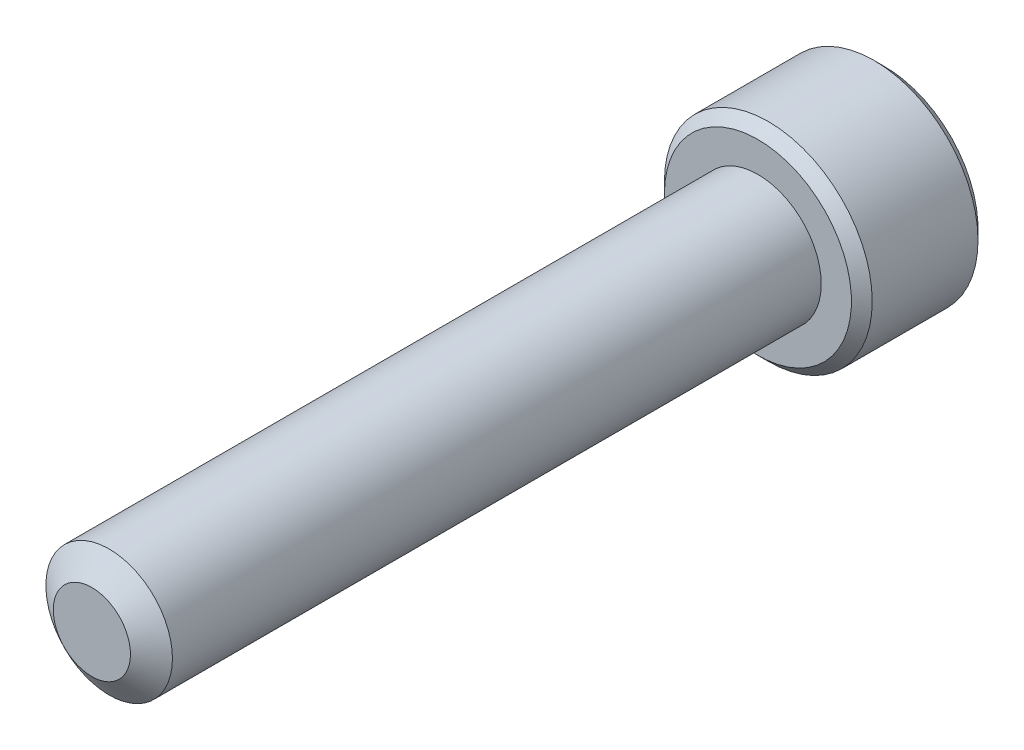
ISO-10303-21;
HEADER;
FILE_DESCRIPTION(('STEP AP214'),'2;1');
FILE_NAME('part.step','',(''),(''),'','','');
FILE_SCHEMA(('AUTOMOTIVE_DESIGN { 1 0 10303 214 1 1 1 1 }'));
ENDSEC;
DATA;
#1=APPLICATION_CONTEXT('core data for automotive mechanical design processes');
#2=APPLICATION_PROTOCOL_DEFINITION('international standard','automotive_design',2000,#1);
#3=PRODUCT_CONTEXT('',#1,'mechanical');
#4=PRODUCT('Part','Part','',(#3));
#5=PRODUCT_RELATED_PRODUCT_CATEGORY('part','',(#4));
#6=PRODUCT_DEFINITION_FORMATION('','',#4);
#7=PRODUCT_DEFINITION_CONTEXT('part definition',#1,'design');
#8=PRODUCT_DEFINITION('design','',#6,#7);
#9=PRODUCT_DEFINITION_SHAPE('','',#8);
#10=(LENGTH_UNIT() NAMED_UNIT(*) SI_UNIT(.MILLI.,.METRE.));
#11=(NAMED_UNIT(*) PLANE_ANGLE_UNIT() SI_UNIT($,.RADIAN.));
#12=(NAMED_UNIT(*) SI_UNIT($,.STERADIAN.) SOLID_ANGLE_UNIT());
#13=UNCERTAINTY_MEASURE_WITH_UNIT(LENGTH_MEASURE(1.E-05),#10,'distance_accuracy_value','');
#14=(GEOMETRIC_REPRESENTATION_CONTEXT(3) GLOBAL_UNCERTAINTY_ASSIGNED_CONTEXT((#13)) GLOBAL_UNIT_ASSIGNED_CONTEXT((#10,
#11,#12)) REPRESENTATION_CONTEXT('',''));
#15=CARTESIAN_POINT('',(0.,0.,0.));
#16=DIRECTION('',(0.,0.,1.));
#17=DIRECTION('',(1.,0.,0.));
#18=AXIS2_PLACEMENT_3D('',#15,#16,#17);
#19=CARTESIAN_POINT('',(0.,0.,-25.4));
#20=DIRECTION('',(0.,0.,1.));
#21=DIRECTION('',(1.,0.,0.));
#22=AXIS2_PLACEMENT_3D('',#19,#20,#21);
#23=CYLINDRICAL_SURFACE('',#22,2.413);
#24=CARTESIAN_POINT('',(0.,0.,-0.659180743038974));
#25=DIRECTION('',(0.,0.,1.));
#26=DIRECTION('',(1.,0.,0.));
#27=AXIS2_PLACEMENT_3D('',#24,#25,#26);
#28=CIRCLE('',#27,2.413);
#29=CARTESIAN_POINT('',(2.413,0.,-0.659180743038974));
#30=VERTEX_POINT('',#29);
#31=EDGE_CURVE('E112',#30,#30,#28,.T.);
#32=ORIENTED_EDGE('',*,*,#31,.F.);
#33=EDGE_LOOP('',(#32));
#34=FACE_BOUND('',#33,.T.);
#35=CARTESIAN_POINT('',(0.,0.,-25.4));
#36=DIRECTION('',(0.,0.,-1.));
#37=DIRECTION('',(-1.,0.,0.));
#38=AXIS2_PLACEMENT_3D('',#35,#36,#37);
#39=CIRCLE('',#38,2.413);
#40=CARTESIAN_POINT('',(-2.413,0.,-25.4));
#41=VERTEX_POINT('',#40);
#42=EDGE_CURVE('E218',#41,#41,#39,.F.);
#43=ORIENTED_EDGE('',*,*,#42,.T.);
#44=EDGE_LOOP('',(#43));
#45=FACE_BOUND('',#44,.T.);
#46=ADVANCED_FACE('F38',(#34,#45),#23,.T.);
#47=CARTESIAN_POINT('',(0.,0.,0.));
#48=DIRECTION('',(0.,0.,-1.));
#49=DIRECTION('',(-1.,0.,0.));
#50=AXIS2_PLACEMENT_3D('',#47,#48,#49);
#51=CONICAL_SURFACE('',#50,1.4715923357461,0.959931088596884);
#52=ORIENTED_EDGE('',*,*,#31,.T.);
#53=EDGE_LOOP('',(#52));
#54=FACE_BOUND('',#53,.T.);
#55=CARTESIAN_POINT('',(0.,0.,0.));
#56=DIRECTION('',(0.,0.,1.));
#57=DIRECTION('',(1.,0.,0.));
#58=AXIS2_PLACEMENT_3D('',#55,#56,#57);
#59=CIRCLE('',#58,1.4715923357461);
#60=CARTESIAN_POINT('',(1.4715923357461,0.,0.));
#61=VERTEX_POINT('',#60);
#62=EDGE_CURVE('E216',#61,#61,#59,.T.);
#63=ORIENTED_EDGE('',*,*,#62,.F.);
#64=EDGE_LOOP('',(#63));
#65=FACE_BOUND('',#64,.T.);
#66=ADVANCED_FACE('F199',(#54,#65),#51,.T.);
#67=CARTESIAN_POINT('',(0.,0.,0.));
#68=DIRECTION('',(0.,0.,1.));
#69=DIRECTION('',(1.,0.,0.));
#70=AXIS2_PLACEMENT_3D('',#67,#68,#69);
#71=PLANE('',#70);
#72=ORIENTED_EDGE('',*,*,#62,.T.);
#73=EDGE_LOOP('',(#72));
#74=FACE_BOUND('',#73,.T.);
#75=ADVANCED_FACE('F196',(#74),#71,.T.);
#76=CARTESIAN_POINT('',(0.,0.,-30.226));
#77=DIRECTION('',(0.,0.,1.));
#78=DIRECTION('',(1.,0.,0.));
#79=AXIS2_PLACEMENT_3D('',#76,#77,#78);
#80=CYLINDRICAL_SURFACE('',#79,3.9624);
#81=CARTESIAN_POINT('',(0.,0.,-29.82976));
#82=DIRECTION('',(0.,0.,-1.));
#83=DIRECTION('',(-1.,0.,0.));
#84=AXIS2_PLACEMENT_3D('',#81,#82,#83);
#85=CIRCLE('',#84,3.9624);
#86=CARTESIAN_POINT('',(-3.9624,0.,-29.82976));
#87=VERTEX_POINT('',#86);
#88=EDGE_CURVE('E46',#87,#87,#85,.F.);
#89=ORIENTED_EDGE('',*,*,#88,.T.);
#90=EDGE_LOOP('',(#89));
#91=FACE_BOUND('',#90,.T.);
#92=CARTESIAN_POINT('',(0.,0.,-25.79624));
#93=DIRECTION('',(0.,0.,-1.));
#94=DIRECTION('',(-1.,0.,0.));
#95=AXIS2_PLACEMENT_3D('',#92,#93,#94);
#96=CIRCLE('',#95,3.9624);
#97=CARTESIAN_POINT('',(-3.9624,0.,-25.79624));
#98=VERTEX_POINT('',#97);
#99=EDGE_CURVE('E175',#98,#98,#96,.T.);
#100=ORIENTED_EDGE('',*,*,#99,.T.);
#101=EDGE_LOOP('',(#100));
#102=FACE_BOUND('',#101,.T.);
#103=ADVANCED_FACE('F180',(#91,#102),#80,.T.);
#104=CARTESIAN_POINT('',(0.,0.,-30.226));
#105=DIRECTION('',(0.,0.,-1.));
#106=DIRECTION('',(-1.,0.,0.));
#107=AXIS2_PLACEMENT_3D('',#104,#105,#106);
#108=PLANE('',#107);
#109=CARTESIAN_POINT('',(0.,0.,-30.226));
#110=DIRECTION('',(0.,0.,-1.));
#111=DIRECTION('',(-1.,0.,0.));
#112=AXIS2_PLACEMENT_3D('',#109,#110,#111);
#113=CIRCLE('',#112,3.56616);
#114=CARTESIAN_POINT('',(-3.56616,0.,-30.226));
#115=VERTEX_POINT('',#114);
#116=EDGE_CURVE('E111',#115,#115,#113,.T.);
#117=ORIENTED_EDGE('',*,*,#116,.T.);
#118=EDGE_LOOP('',(#117));
#119=FACE_BOUND('',#118,.T.);
#120=CARTESIAN_POINT('',(0.,0.,-30.226));
#121=DIRECTION('',(0.,0.,-1.));
#122=DIRECTION('',(-1.,0.,0.));
#123=AXIS2_PLACEMENT_3D('',#120,#121,#122);
#124=CIRCLE('',#123,2.29135888084633);
#125=CARTESIAN_POINT('',(-1.984375,1.14567944042316,-30.226));
#126=VERTEX_POINT('',#125);
#127=CARTESIAN_POINT('',(0.,2.29135888084633,-30.226));
#128=VERTEX_POINT('',#127);
#129=EDGE_CURVE('E92',#126,#128,#124,.T.);
#130=ORIENTED_EDGE('',*,*,#129,.F.);
#131=CARTESIAN_POINT('',(-1.984375,-1.14567944042316,-30.226));
#132=VERTEX_POINT('',#131);
#133=EDGE_CURVE('E52',#132,#126,#124,.T.);
#134=ORIENTED_EDGE('',*,*,#133,.F.);
#135=CARTESIAN_POINT('',(0.,-2.29135888084633,-30.226));
#136=VERTEX_POINT('',#135);
#137=EDGE_CURVE('E278',#136,#132,#124,.T.);
#138=ORIENTED_EDGE('',*,*,#137,.F.);
#139=CARTESIAN_POINT('',(1.984375,-1.14567944042316,-30.226));
#140=VERTEX_POINT('',#139);
#141=EDGE_CURVE('E59',#140,#136,#124,.T.);
#142=ORIENTED_EDGE('',*,*,#141,.F.);
#143=CARTESIAN_POINT('',(1.984375,1.14567944042316,-30.226));
#144=VERTEX_POINT('',#143);
#145=EDGE_CURVE('E133',#144,#140,#124,.T.);
#146=ORIENTED_EDGE('',*,*,#145,.F.);
#147=EDGE_CURVE('E101',#128,#144,#124,.T.);
#148=ORIENTED_EDGE('',*,*,#147,.F.);
#149=EDGE_LOOP('',(#130,#134,#138,#142,#146,#148));
#150=FACE_BOUND('',#149,.T.);
#151=ADVANCED_FACE('F132',(#119,#150),#108,.T.);
#152=CARTESIAN_POINT('',(0.,0.,-25.4));
#153=DIRECTION('',(0.,0.,-1.));
#154=DIRECTION('',(-1.,0.,0.));
#155=AXIS2_PLACEMENT_3D('',#152,#153,#154);
#156=PLANE('',#155);
#157=CARTESIAN_POINT('',(0.,0.,-25.4));
#158=DIRECTION('',(0.,0.,-1.));
#159=DIRECTION('',(-1.,0.,0.));
#160=AXIS2_PLACEMENT_3D('',#157,#158,#159);
#161=CIRCLE('',#160,3.56616);
#162=CARTESIAN_POINT('',(-3.56616,0.,-25.4));
#163=VERTEX_POINT('',#162);
#164=EDGE_CURVE('E11',#163,#163,#161,.F.);
#165=ORIENTED_EDGE('',*,*,#164,.T.);
#166=EDGE_LOOP('',(#165));
#167=FACE_BOUND('',#166,.T.);
#168=ORIENTED_EDGE('',*,*,#42,.F.);
#169=EDGE_LOOP('',(#168));
#170=FACE_BOUND('',#169,.T.);
#171=ADVANCED_FACE('F189',(#167,#170),#156,.F.);
#172=CARTESIAN_POINT('',(0.,0.,-30.226));
#173=DIRECTION('',(0.,0.,-1.));
#174=DIRECTION('',(-1.,0.,0.));
#175=AXIS2_PLACEMENT_3D('',#172,#173,#174);
#176=CONICAL_SURFACE('',#175,2.29135888084633,0.78539816339745);
#177=ORIENTED_EDGE('',*,*,#147,.T.);
#178=CARTESIAN_POINT('',(-0.000199999999999787,2.29147435090016,-30.2261154787818));
#179=CARTESIAN_POINT('',(0.0680159951668027,2.25208982772757,-30.1867628522639));
#180=CARTESIAN_POINT('',(0.137372685106966,2.21204672412052,-30.1497213104462));
#181=CARTESIAN_POINT('',(0.278798800452188,2.13039431835551,-30.0818988584233));
#182=CARTESIAN_POINT('',(0.350881678736783,2.08877724917394,-30.0511556890918));
#183=CARTESIAN_POINT('',(0.496233397266004,2.00485839535392,-29.9984918888112));
#184=CARTESIAN_POINT('',(0.569465212486938,1.96257798712287,-29.97643887588));
#185=CARTESIAN_POINT('',(0.717541182594705,1.87708628592063,-29.9424614929439));
#186=CARTESIAN_POINT('',(0.792380812753423,1.83387760530244,-29.9305117560917));
#187=CARTESIAN_POINT('',(0.921360414543814,1.75941119748879,-29.9197300990819));
#188=CARTESIAN_POINT('',(0.975333715772441,1.72824969749539,-29.9181338990591));
#189=CARTESIAN_POINT('',(1.0831921185198,1.66597761963484,-29.9208218388653));
#190=CARTESIAN_POINT('',(1.13707718248552,1.63486706344893,-29.9251080403405));
#191=CARTESIAN_POINT('',(1.2443385382486,1.57293969082547,-29.9393168730135));
#192=CARTESIAN_POINT('',(1.29771419276014,1.54212324232506,-29.9492458104523));
#193=CARTESIAN_POINT('',(1.40354251740889,1.48102323060122,-29.9741950842745));
#194=CARTESIAN_POINT('',(1.4559952579711,1.45073962671789,-29.9892150303895));
#195=CARTESIAN_POINT('',(1.59035733896365,1.37316564308797,-30.0338078516357));
#196=CARTESIAN_POINT('',(1.67143335715832,1.32635638215845,-30.0667429959383));
#197=CARTESIAN_POINT('',(1.79064830672984,1.25752759893191,-30.1223424412022));
#198=CARTESIAN_POINT('',(1.829934924386,1.23484545965257,-30.1418775920519));
#199=CARTESIAN_POINT('',(1.90778036186805,1.18990137536713,-30.1827287381194));
#200=CARTESIAN_POINT('',(1.9463396111017,1.16763918244233,-30.2040436395684));
#201=CARTESIAN_POINT('',(1.984575,1.14556397036933,-30.2261154787818));
#202=B_SPLINE_CURVE_WITH_KNOTS('',3,(#178,#179,#180,#181,#182,#183,#184,#185,#186,#187,#188,
#189,#190,#191,#192,#193,#194,#195,#196,#197,#198,#199,#200,#201),.UNSPECIFIED.,.F.,.F.,(4,2,2,
2,2,2,2,2,2,2,2,4),(0.,0.264339630306627,0.530219665093694,0.791876416371459,1.05287424418109,
1.239639843932,1.42647091743852,1.61351120244034,1.8005371524754,2.09764209964316,
2.24579179873714,2.39385111134157),.UNSPECIFIED.);
#203=EDGE_CURVE('E106',#128,#144,#202,.T.);
#204=ORIENTED_EDGE('',*,*,#203,.F.);
#205=EDGE_LOOP('',(#177,#204));
#206=FACE_BOUND('',#205,.T.);
#207=ADVANCED_FACE('F107',(#206),#176,.F.);
#208=ORIENTED_EDGE('',*,*,#145,.T.);
#209=CARTESIAN_POINT('',(1.984375,-2.28495242157822,-30.9609840788166));
#210=CARTESIAN_POINT('',(1.984375,-2.22931635455402,-30.9189866855508));
#211=CARTESIAN_POINT('',(1.984375,-2.17336876548389,-30.8773960540763));
#212=CARTESIAN_POINT('',(1.984375,-2.06072770258171,-30.7952084614715));
#213=CARTESIAN_POINT('',(1.984375,-2.00403404503435,-30.754611752405));
#214=CARTESIAN_POINT('',(1.984375,-1.88936329173488,-30.6743035031747));
#215=CARTESIAN_POINT('',(1.984375,-1.83137965519348,-30.6346012588133));
#216=CARTESIAN_POINT('',(1.984375,-1.7144280213784,-30.5566851734013));
#217=CARTESIAN_POINT('',(1.984375,-1.65546009407227,-30.5184712271944));
#218=CARTESIAN_POINT('',(1.984375,-1.47005472306035,-30.4022528340136));
#219=CARTESIAN_POINT('',(1.984375,-1.34163909427883,-30.3273478868724));
#220=CARTESIAN_POINT('',(1.984375,-1.0784038470548,-30.1903302154397));
#221=CARTESIAN_POINT('',(1.984375,-0.943607781407423,-30.1281743664824));
#222=CARTESIAN_POINT('',(1.984375,-0.74127510044488,-30.0521325786886));
#223=CARTESIAN_POINT('',(1.984375,-0.676735408881093,-30.030308061326));
#224=CARTESIAN_POINT('',(1.984375,-0.54609811811276,-29.9918404635378));
#225=CARTESIAN_POINT('',(1.984375,-0.480000411919955,-29.9751977400655));
#226=CARTESIAN_POINT('',(1.984375,-0.347746170028531,-29.9482353808697));
#227=CARTESIAN_POINT('',(1.984375,-0.281612071479122,-29.9378074097359));
#228=CARTESIAN_POINT('',(1.984375,-0.14863662005235,-29.9234781473766));
#229=CARTESIAN_POINT('',(1.984375,-0.0817953907393247,-29.9195757342274));
#230=CARTESIAN_POINT('',(1.984375,0.0495156750890629,-29.9185870513327));
#231=CARTESIAN_POINT('',(1.984375,0.11398377510299,-29.921259178875));
#232=CARTESIAN_POINT('',(1.984375,0.242367515846176,-29.9327392104975));
#233=CARTESIAN_POINT('',(1.984375,0.306283102295918,-29.9415477106392));
#234=CARTESIAN_POINT('',(1.984375,0.434181040262183,-29.9649690213329));
#235=CARTESIAN_POINT('',(1.984375,0.498145026858308,-29.9796806062321));
#236=CARTESIAN_POINT('',(1.984375,0.624675616953006,-30.0141261814121));
#237=CARTESIAN_POINT('',(1.984375,0.687242336899688,-30.0338597514492));
#238=CARTESIAN_POINT('',(1.984375,0.884225483826086,-30.1034122372308));
#239=CARTESIAN_POINT('',(1.984375,1.01583674256468,-30.1611524112565));
#240=CARTESIAN_POINT('',(1.984375,1.27288659242652,-30.2895303365888));
#241=CARTESIAN_POINT('',(1.984375,1.3983008827048,-30.3602144249194));
#242=CARTESIAN_POINT('',(1.984375,1.57956687990221,-30.4705166638132));
#243=CARTESIAN_POINT('',(1.984375,1.63738271299424,-30.5069698294754));
#244=CARTESIAN_POINT('',(1.984375,1.75202215386201,-30.5814159632917));
#245=CARTESIAN_POINT('',(1.984375,1.80884568601361,-30.6194090480781));
#246=CARTESIAN_POINT('',(1.984375,1.92116923084255,-30.6963388088931));
#247=CARTESIAN_POINT('',(1.984375,1.97667624512253,-30.7352653130388));
#248=CARTESIAN_POINT('',(1.984375,2.08693170717166,-30.8141477461214));
#249=CARTESIAN_POINT('',(1.984375,2.14168035934792,-30.854103389024));
#250=CARTESIAN_POINT('',(1.984375,2.19611149046622,-30.8944806112854));
#251=B_SPLINE_CURVE_WITH_KNOTS('',3,(#209,#210,#211,#212,#213,#214,#215,#216,#217,#218,#219,
#220,#221,#222,#223,#224,#225,#226,#227,#228,#229,#230,#231,#232,#233,#234,#235,#236,#237,#238,
#239,#240,#241,#242,#243,#244,#245,#246,#247,#248,#249,#250),.UNSPECIFIED.,.F.,.F.,(4,2,2,2,2,2,
2,2,2,2,2,2,2,2,2,2,2,2,2,2,4),(0.,0.209126070008321,0.418304637356568,0.629103979977996,
0.839888401371182,1.28549951116127,1.72957750768351,1.93379389749971,2.13802435186698,
2.33858179514333,2.53910475350639,2.73236963400794,2.92565329006886,3.12231577097487,
3.31896180041345,3.74886295245172,4.18033428125362,4.38536017180289,4.59040161996382,
4.79377749165107,4.99709743524131),.UNSPECIFIED.);
#252=EDGE_CURVE('E100',#144,#140,#251,.F.);
#253=ORIENTED_EDGE('',*,*,#252,.F.);
#254=EDGE_LOOP('',(#208,#253));
#255=FACE_BOUND('',#254,.T.);
#256=ADVANCED_FACE('F284',(#255),#176,.F.);
#257=ORIENTED_EDGE('',*,*,#141,.T.);
#258=CARTESIAN_POINT('',(1.984575,-1.14556397036933,-30.2261154787818));
#259=CARTESIAN_POINT('',(1.9163590048332,-1.18494849354192,-30.1867628522639));
#260=CARTESIAN_POINT('',(1.84700231489303,-1.22499159714897,-30.1497213104462));
#261=CARTESIAN_POINT('',(1.70557619954781,-1.30664400291398,-30.0818988584233));
#262=CARTESIAN_POINT('',(1.63349332126322,-1.34826107209555,-30.0511556890918));
#263=CARTESIAN_POINT('',(1.488141602734,-1.43217992591557,-29.9984918888112));
#264=CARTESIAN_POINT('',(1.41490978751306,-1.47446033414663,-29.97643887588));
#265=CARTESIAN_POINT('',(1.26683381740529,-1.55995203534886,-29.9424614929439));
#266=CARTESIAN_POINT('',(1.19199418724658,-1.60316071596705,-29.9305117560917));
#267=CARTESIAN_POINT('',(1.06301458545619,-1.6776271237807,-29.9197300990819));
#268=CARTESIAN_POINT('',(1.00904128422756,-1.7087886237741,-29.9181338990591));
#269=CARTESIAN_POINT('',(0.901182881480201,-1.77106070163465,-29.9208218388653));
#270=CARTESIAN_POINT('',(0.847297817514478,-1.80217125782056,-29.9251080403405));
#271=CARTESIAN_POINT('',(0.740036461751398,-1.86409863044402,-29.9393168730135));
#272=CARTESIAN_POINT('',(0.686660807239862,-1.89491507894443,-29.9492458104523));
#273=CARTESIAN_POINT('',(0.580832482591106,-1.95601509066827,-29.9741950842745));
#274=CARTESIAN_POINT('',(0.5283797420289,-1.9862986945516,-29.9892150303895));
#275=CARTESIAN_POINT('',(0.394017661036352,-2.06387267818152,-30.0338078516357));
#276=CARTESIAN_POINT('',(0.312941642841676,-2.11068193911104,-30.0667429959383));
#277=CARTESIAN_POINT('',(0.193726693270161,-2.17951072233758,-30.1223424412022));
#278=CARTESIAN_POINT('',(0.154440075613999,-2.20219286161692,-30.1418775920519));
#279=CARTESIAN_POINT('',(0.0765946381319474,-2.24713694590237,-30.1827287381194));
#280=CARTESIAN_POINT('',(0.0380353888983019,-2.26939913882716,-30.2040436395684));
#281=CARTESIAN_POINT('',(-0.000199999999999489,-2.29147435090017,-30.2261154787818));
#282=B_SPLINE_CURVE_WITH_KNOTS('',3,(#258,#259,#260,#261,#262,#263,#264,#265,#266,#267,#268,
#269,#270,#271,#272,#273,#274,#275,#276,#277,#278,#279,#280,#281),.UNSPECIFIED.,.F.,.F.,(4,2,2,
2,2,2,2,2,2,2,2,4),(0.,0.264339630306627,0.530219665093694,0.791876416371459,1.05287424418109,
1.239639843932,1.42647091743852,1.61351120244034,1.8005371524754,2.09764209964316,
2.24579179873714,2.39385111134157),.UNSPECIFIED.);
#283=EDGE_CURVE('E143',#140,#136,#282,.T.);
#284=ORIENTED_EDGE('',*,*,#283,.F.);
#285=EDGE_LOOP('',(#257,#284));
#286=FACE_BOUND('',#285,.T.);
#287=ADVANCED_FACE('F281',(#286),#176,.F.);
#288=ORIENTED_EDGE('',*,*,#137,.T.);
#289=CARTESIAN_POINT('',(0.000200000000000205,-2.29147435090017,-30.2261154787818));
#290=CARTESIAN_POINT('',(-0.0680159951668026,-2.25208982772757,-30.1867628522639));
#291=CARTESIAN_POINT('',(-0.137372685106966,-2.21204672412052,-30.1497213104462));
#292=CARTESIAN_POINT('',(-0.278798800452187,-2.13039431835551,-30.0818988584233));
#293=CARTESIAN_POINT('',(-0.350881678736782,-2.08877724917394,-30.0511556890918));
#294=CARTESIAN_POINT('',(-0.496233397266003,-2.00485839535392,-29.9984918888112));
#295=CARTESIAN_POINT('',(-0.569465212486937,-1.96257798712287,-29.97643887588));
#296=CARTESIAN_POINT('',(-0.717541182594704,-1.87708628592063,-29.9424614929439));
#297=CARTESIAN_POINT('',(-0.792380812753422,-1.83387760530244,-29.9305117560917));
#298=CARTESIAN_POINT('',(-0.921360414543813,-1.75941119748879,-29.9197300990819));
#299=CARTESIAN_POINT('',(-0.97533371577244,-1.72824969749539,-29.9181338990591));
#300=CARTESIAN_POINT('',(-1.0831921185198,-1.66597761963484,-29.9208218388653));
#301=CARTESIAN_POINT('',(-1.13707718248552,-1.63486706344893,-29.9251080403405));
#302=CARTESIAN_POINT('',(-1.2443385382486,-1.57293969082547,-29.9393168730135));
#303=CARTESIAN_POINT('',(-1.29771419276014,-1.54212324232506,-29.9492458104523));
#304=CARTESIAN_POINT('',(-1.40354251740889,-1.48102323060122,-29.9741950842745));
#305=CARTESIAN_POINT('',(-1.4559952579711,-1.45073962671789,-29.9892150303895));
#306=CARTESIAN_POINT('',(-1.59035733896365,-1.37316564308797,-30.0338078516357));
#307=CARTESIAN_POINT('',(-1.67143335715832,-1.32635638215845,-30.0667429959383));
#308=CARTESIAN_POINT('',(-1.79064830672984,-1.25752759893191,-30.1223424412022));
#309=CARTESIAN_POINT('',(-1.829934924386,-1.23484545965257,-30.1418775920519));
#310=CARTESIAN_POINT('',(-1.90778036186805,-1.18990137536713,-30.1827287381194));
#311=CARTESIAN_POINT('',(-1.9463396111017,-1.16763918244233,-30.2040436395684));
#312=CARTESIAN_POINT('',(-1.984575,-1.14556397036933,-30.2261154787818));
#313=B_SPLINE_CURVE_WITH_KNOTS('',3,(#289,#290,#291,#292,#293,#294,#295,#296,#297,#298,#299,
#300,#301,#302,#303,#304,#305,#306,#307,#308,#309,#310,#311,#312),.UNSPECIFIED.,.F.,.F.,(4,2,2,
2,2,2,2,2,2,2,2,4),(0.,0.264339630306627,0.530219665093694,0.791876416371458,1.05287424418109,
1.239639843932,1.42647091743852,1.61351120244034,1.8005371524754,2.09764209964316,
2.24579179873713,2.39385111134157),.UNSPECIFIED.);
#314=EDGE_CURVE('E255',#136,#132,#313,.T.);
#315=ORIENTED_EDGE('',*,*,#314,.F.);
#316=EDGE_LOOP('',(#288,#315));
#317=FACE_BOUND('',#316,.T.);
#318=ADVANCED_FACE('F280',(#317),#176,.F.);
#319=ORIENTED_EDGE('',*,*,#133,.T.);
#320=CARTESIAN_POINT('',(-1.984375,-2.28495242191067,-30.9609840790676));
#321=CARTESIAN_POINT('',(-1.984375,-2.22931635487714,-30.9189866857921));
#322=CARTESIAN_POINT('',(-1.984375,-2.17336876579766,-30.877396054308));
#323=CARTESIAN_POINT('',(-1.984375,-2.06072770287666,-30.7952084616839));
#324=CARTESIAN_POINT('',(-1.984375,-2.00403404531985,-30.7546117526079));
#325=CARTESIAN_POINT('',(-1.984375,-1.88936329200117,-30.6743035033582));
#326=CARTESIAN_POINT('',(-1.984375,-1.83137965544999,-30.6346012589872));
#327=CARTESIAN_POINT('',(-1.984375,-1.71442802161519,-30.556685173556));
#328=CARTESIAN_POINT('',(-1.984375,-1.65546009429911,-30.5184712273396));
#329=CARTESIAN_POINT('',(-1.984375,-1.47005472325436,-30.4022528341287));
#330=CARTESIAN_POINT('',(-1.984375,-1.34163909444949,-30.3273478869673));
#331=CARTESIAN_POINT('',(-1.984375,-1.07840384717678,-30.1903302154972));
#332=CARTESIAN_POINT('',(-1.984375,-0.943607781504097,-30.1281743665226));
#333=CARTESIAN_POINT('',(-1.984375,-0.741275100522508,-30.052132578716));
#334=CARTESIAN_POINT('',(-1.984375,-0.676735408966696,-30.0303080613539));
#335=CARTESIAN_POINT('',(-1.984375,-0.546098118214575,-29.9918404635651));
#336=CARTESIAN_POINT('',(-1.984375,-0.480000412030006,-29.9751977400917));
#337=CARTESIAN_POINT('',(-1.984375,-0.347746170154784,-29.9482353808918));
#338=CARTESIAN_POINT('',(-1.984375,-0.281612071613336,-29.937807409755));
#339=CARTESIAN_POINT('',(-1.984375,-0.148636620202218,-29.9234781473881));
#340=CARTESIAN_POINT('',(-1.984375,-0.0817953908968863,-29.9195757342341));
#341=CARTESIAN_POINT('',(-1.984375,0.0495156749173051,-29.9185870513286));
#342=CARTESIAN_POINT('',(-1.984375,0.11398377492471,-29.921259178865));
#343=CARTESIAN_POINT('',(-1.984375,0.242367515655504,-29.9327392104746));
#344=CARTESIAN_POINT('',(-1.984375,0.306283102099377,-29.9415477106093));
#345=CARTESIAN_POINT('',(-1.984375,0.434181040054054,-29.9649690212885));
#346=CARTESIAN_POINT('',(-1.984375,0.498145026644479,-29.9796806061801));
#347=CARTESIAN_POINT('',(-1.984375,0.624675616728327,-30.0141261813447));
#348=CARTESIAN_POINT('',(-1.984375,0.687242336669858,-30.033859751374));
#349=CARTESIAN_POINT('',(-1.984375,0.884225483546211,-30.1034122371188));
#350=CARTESIAN_POINT('',(-1.984375,1.01583674224242,-30.1611524111108));
#351=CARTESIAN_POINT('',(-1.984375,1.27288659202273,-30.2895303363718));
#352=CARTESIAN_POINT('',(-1.984375,1.3983008822619,-30.3602144246649));
#353=CARTESIAN_POINT('',(-1.984375,1.57956687940504,-30.4705166635036));
#354=CARTESIAN_POINT('',(-1.984375,1.63738271248118,-30.5069698291489));
#355=CARTESIAN_POINT('',(-1.984375,1.75202215331742,-30.5814159629313));
#356=CARTESIAN_POINT('',(-1.984375,1.80884568545336,-30.6194090477007));
#357=CARTESIAN_POINT('',(-1.984375,1.92116923025136,-30.6963388084819));
#358=CARTESIAN_POINT('',(-1.984375,1.97667624451606,-30.7352653126108));
#359=CARTESIAN_POINT('',(-1.984375,2.08693170653473,-30.8141477456598));
#360=CARTESIAN_POINT('',(-1.984375,2.14168035869581,-30.8541033885457));
#361=CARTESIAN_POINT('',(-1.984375,2.19611148979895,-30.8944806107903));
#362=B_SPLINE_CURVE_WITH_KNOTS('',3,(#320,#321,#322,#323,#324,#325,#326,#327,#328,#329,#330,
#331,#332,#333,#334,#335,#336,#337,#338,#339,#340,#341,#342,#343,#344,#345,#346,#347,#348,#349,
#350,#351,#352,#353,#354,#355,#356,#357,#358,#359,#360,#361),.UNSPECIFIED.,.F.,.F.,(4,2,2,2,2,2,
2,2,2,2,2,2,2,2,2,2,2,2,2,2,4),(0.,0.209126070048126,0.418304637436192,0.629103980098179,
0.839888401531929,1.28549951141299,1.72957750802533,1.93379389781847,2.13802435216272,
2.33858179541699,2.53910475375796,2.7323696342393,2.92565329027999,3.12231577116422,
3.31896180058103,3.74886295246281,4.18033428110719,4.38536017158908,4.59040161968262,
4.79377749130339,4.99709743482717),.UNSPECIFIED.);
#363=EDGE_CURVE('E122',#132,#126,#362,.T.);
#364=ORIENTED_EDGE('',*,*,#363,.F.);
#365=EDGE_LOOP('',(#319,#364));
#366=FACE_BOUND('',#365,.T.);
#367=ADVANCED_FACE('F293',(#366),#176,.F.);
#368=ORIENTED_EDGE('',*,*,#129,.T.);
#369=CARTESIAN_POINT('',(-1.984575,1.14556397036933,-30.2261154787818));
#370=CARTESIAN_POINT('',(-1.9163590048332,1.18494849354192,-30.1867628522639));
#371=CARTESIAN_POINT('',(-1.84700231489303,1.22499159714897,-30.1497213104462));
#372=CARTESIAN_POINT('',(-1.70557619954781,1.30664400291398,-30.0818988584233));
#373=CARTESIAN_POINT('',(-1.63349332126322,1.34826107209555,-30.0511556890918));
#374=CARTESIAN_POINT('',(-1.488141602734,1.43217992591557,-29.9984918888112));
#375=CARTESIAN_POINT('',(-1.41490978751306,1.47446033414662,-29.97643887588));
#376=CARTESIAN_POINT('',(-1.26683381740529,1.55995203534886,-29.9424614929439));
#377=CARTESIAN_POINT('',(-1.19199418724658,1.60316071596705,-29.9305117560917));
#378=CARTESIAN_POINT('',(-1.06301458545619,1.6776271237807,-29.9197300990819));
#379=CARTESIAN_POINT('',(-1.00904128422756,1.7087886237741,-29.9181338990591));
#380=CARTESIAN_POINT('',(-0.901182881480201,1.77106070163465,-29.9208218388653));
#381=CARTESIAN_POINT('',(-0.847297817514478,1.80217125782056,-29.9251080403405));
#382=CARTESIAN_POINT('',(-0.740036461751397,1.86409863044402,-29.9393168730135));
#383=CARTESIAN_POINT('',(-0.686660807239861,1.89491507894443,-29.9492458104523));
#384=CARTESIAN_POINT('',(-0.580832482591105,1.95601509066827,-29.9741950842745));
#385=CARTESIAN_POINT('',(-0.5283797420289,1.9862986945516,-29.9892150303895));
#386=CARTESIAN_POINT('',(-0.394017661036353,2.06387267818152,-30.0338078516357));
#387=CARTESIAN_POINT('',(-0.312941642841677,2.11068193911104,-30.0667429959383));
#388=CARTESIAN_POINT('',(-0.193726693270161,2.17951072233758,-30.1223424412022));
#389=CARTESIAN_POINT('',(-0.154440075613998,2.20219286161692,-30.1418775920519));
#390=CARTESIAN_POINT('',(-0.0765946381319461,2.24713694590237,-30.1827287381194));
#391=CARTESIAN_POINT('',(-0.0380353888983003,2.26939913882716,-30.2040436395684));
#392=CARTESIAN_POINT('',(0.000200000000000288,2.29147435090017,-30.2261154787818));
#393=B_SPLINE_CURVE_WITH_KNOTS('',3,(#369,#370,#371,#372,#373,#374,#375,#376,#377,#378,#379,
#380,#381,#382,#383,#384,#385,#386,#387,#388,#389,#390,#391,#392),.UNSPECIFIED.,.F.,.F.,(4,2,2,
2,2,2,2,2,2,2,2,4),(0.,0.264339630306627,0.530219665093694,0.791876416371459,1.05287424418109,
1.239639843932,1.42647091743852,1.61351120244034,1.8005371524754,2.09764209964316,
2.24579179873714,2.39385111134157),.UNSPECIFIED.);
#394=EDGE_CURVE('E96',#126,#128,#393,.T.);
#395=ORIENTED_EDGE('',*,*,#394,.F.);
#396=EDGE_LOOP('',(#368,#395));
#397=FACE_BOUND('',#396,.T.);
#398=ADVANCED_FACE('F94',(#397),#176,.F.);
#399=CARTESIAN_POINT('',(1.984375,3.43703832126949,-27.2494375));
#400=DIRECTION('',(0.,0.,-1.));
#401=DIRECTION('',(-1.,0.,0.));
#402=AXIS2_PLACEMENT_3D('',#399,#400,#401);
#403=PLANE('',#402);
#404=DIRECTION('',(0.866025403784439,0.5,0.));
#405=VECTOR('',#404,1.);
#406=CARTESIAN_POINT('',(-1.984375,1.14567944042316,-27.2494375));
#407=LINE('',#406,#405);
#408=CARTESIAN_POINT('',(-1.984375,1.14567944042316,-27.2494375));
#409=VERTEX_POINT('',#408);
#410=CARTESIAN_POINT('',(0.,2.29135888084633,-27.2494375));
#411=VERTEX_POINT('',#410);
#412=EDGE_CURVE('E121',#409,#411,#407,.T.);
#413=ORIENTED_EDGE('',*,*,#412,.T.);
#414=DIRECTION('',(0.866025403784439,-0.5,0.));
#415=VECTOR('',#414,1.);
#416=CARTESIAN_POINT('',(0.,2.29135888084633,-27.2494375));
#417=LINE('',#416,#415);
#418=CARTESIAN_POINT('',(1.984375,1.14567944042316,-27.2494375));
#419=VERTEX_POINT('',#418);
#420=EDGE_CURVE('E126',#411,#419,#417,.T.);
#421=ORIENTED_EDGE('',*,*,#420,.T.);
#422=DIRECTION('',(0.,-1.,0.));
#423=VECTOR('',#422,1.);
#424=CARTESIAN_POINT('',(1.984375,1.14567944042316,-27.2494375));
#425=LINE('',#424,#423);
#426=CARTESIAN_POINT('',(1.984375,-1.14567944042316,-27.2494375));
#427=VERTEX_POINT('',#426);
#428=EDGE_CURVE('E241',#419,#427,#425,.T.);
#429=ORIENTED_EDGE('',*,*,#428,.T.);
#430=DIRECTION('',(-0.866025403784439,-0.5,0.));
#431=VECTOR('',#430,1.);
#432=CARTESIAN_POINT('',(1.984375,-1.14567944042316,-27.2494375));
#433=LINE('',#432,#431);
#434=CARTESIAN_POINT('',(0.,-2.29135888084633,-27.2494375));
#435=VERTEX_POINT('',#434);
#436=EDGE_CURVE('E238',#427,#435,#433,.T.);
#437=ORIENTED_EDGE('',*,*,#436,.T.);
#438=DIRECTION('',(-0.866025403784439,0.5,0.));
#439=VECTOR('',#438,1.);
#440=CARTESIAN_POINT('',(0.,-2.29135888084633,-27.2494375));
#441=LINE('',#440,#439);
#442=CARTESIAN_POINT('',(-1.984375,-1.14567944042316,-27.2494375));
#443=VERTEX_POINT('',#442);
#444=EDGE_CURVE('E235',#435,#443,#441,.T.);
#445=ORIENTED_EDGE('',*,*,#444,.T.);
#446=DIRECTION('',(0.,1.,0.));
#447=VECTOR('',#446,1.);
#448=CARTESIAN_POINT('',(-1.984375,-1.14567944042316,-27.2494375));
#449=LINE('',#448,#447);
#450=EDGE_CURVE('E129',#443,#409,#449,.T.);
#451=ORIENTED_EDGE('',*,*,#450,.T.);
#452=EDGE_LOOP('',(#413,#421,#429,#437,#445,#451));
#453=FACE_BOUND('',#452,.T.);
#454=ADVANCED_FACE('F163',(#453),#403,.T.);
#455=CARTESIAN_POINT('',(0.,2.29135888084633,-27.2494375));
#456=DIRECTION('',(0.5,0.866025403784439,0.));
#457=DIRECTION('',(-0.866025403784439,0.5,0.));
#458=AXIS2_PLACEMENT_3D('',#455,#456,#457);
#459=PLANE('',#458);
#460=DIRECTION('',(0.,0.,-1.));
#461=VECTOR('',#460,1.);
#462=CARTESIAN_POINT('',(0.,2.29135888084633,-27.2494375));
#463=LINE('',#462,#461);
#464=EDGE_CURVE('E118',#411,#128,#463,.T.);
#465=ORIENTED_EDGE('',*,*,#464,.T.);
#466=ORIENTED_EDGE('',*,*,#203,.T.);
#467=DIRECTION('',(0.,0.,-1.));
#468=VECTOR('',#467,1.);
#469=CARTESIAN_POINT('',(1.984375,1.14567944042316,-27.2494375));
#470=LINE('',#469,#468);
#471=EDGE_CURVE('E128',#419,#144,#470,.T.);
#472=ORIENTED_EDGE('',*,*,#471,.F.);
#473=ORIENTED_EDGE('',*,*,#420,.F.);
#474=EDGE_LOOP('',(#465,#466,#472,#473));
#475=FACE_BOUND('',#474,.T.);
#476=ADVANCED_FACE('F124',(#475),#459,.F.);
#477=CARTESIAN_POINT('',(1.984375,1.14567944042316,-27.2494375));
#478=DIRECTION('',(1.,0.,0.));
#479=DIRECTION('',(0.,0.,-1.));
#480=AXIS2_PLACEMENT_3D('',#477,#478,#479);
#481=PLANE('',#480);
#482=ORIENTED_EDGE('',*,*,#471,.T.);
#483=ORIENTED_EDGE('',*,*,#252,.T.);
#484=DIRECTION('',(0.,0.,-1.));
#485=VECTOR('',#484,1.);
#486=CARTESIAN_POINT('',(1.984375,-1.14567944042316,-27.2494375));
#487=LINE('',#486,#485);
#488=EDGE_CURVE('E224',#427,#140,#487,.T.);
#489=ORIENTED_EDGE('',*,*,#488,.F.);
#490=ORIENTED_EDGE('',*,*,#428,.F.);
#491=EDGE_LOOP('',(#482,#483,#489,#490));
#492=FACE_BOUND('',#491,.T.);
#493=ADVANCED_FACE('F152',(#492),#481,.F.);
#494=CARTESIAN_POINT('',(1.984375,-1.14567944042316,-27.2494375));
#495=DIRECTION('',(0.5,-0.866025403784439,0.));
#496=DIRECTION('',(0.866025403784439,0.5,0.));
#497=AXIS2_PLACEMENT_3D('',#494,#495,#496);
#498=PLANE('',#497);
#499=ORIENTED_EDGE('',*,*,#488,.T.);
#500=ORIENTED_EDGE('',*,*,#283,.T.);
#501=DIRECTION('',(0.,0.,-1.));
#502=VECTOR('',#501,1.);
#503=CARTESIAN_POINT('',(0.,-2.29135888084633,-27.2494375));
#504=LINE('',#503,#502);
#505=EDGE_CURVE('E227',#435,#136,#504,.T.);
#506=ORIENTED_EDGE('',*,*,#505,.F.);
#507=ORIENTED_EDGE('',*,*,#436,.F.);
#508=EDGE_LOOP('',(#499,#500,#506,#507));
#509=FACE_BOUND('',#508,.T.);
#510=ADVANCED_FACE('F156',(#509),#498,.F.);
#511=CARTESIAN_POINT('',(0.,-2.29135888084633,-27.2494375));
#512=DIRECTION('',(-0.5,-0.866025403784439,0.));
#513=DIRECTION('',(0.866025403784439,-0.5,0.));
#514=AXIS2_PLACEMENT_3D('',#511,#512,#513);
#515=PLANE('',#514);
#516=ORIENTED_EDGE('',*,*,#505,.T.);
#517=ORIENTED_EDGE('',*,*,#314,.T.);
#518=DIRECTION('',(0.,0.,-1.));
#519=VECTOR('',#518,1.);
#520=CARTESIAN_POINT('',(-1.984375,-1.14567944042316,-27.2494375));
#521=LINE('',#520,#519);
#522=EDGE_CURVE('E230',#443,#132,#521,.T.);
#523=ORIENTED_EDGE('',*,*,#522,.F.);
#524=ORIENTED_EDGE('',*,*,#444,.F.);
#525=EDGE_LOOP('',(#516,#517,#523,#524));
#526=FACE_BOUND('',#525,.T.);
#527=ADVANCED_FACE('F263',(#526),#515,.F.);
#528=CARTESIAN_POINT('',(-1.984375,-1.14567944042316,-27.2494375));
#529=DIRECTION('',(-1.,0.,0.));
#530=DIRECTION('',(0.,-1.,0.));
#531=AXIS2_PLACEMENT_3D('',#528,#529,#530);
#532=PLANE('',#531);
#533=ORIENTED_EDGE('',*,*,#522,.T.);
#534=ORIENTED_EDGE('',*,*,#363,.T.);
#535=DIRECTION('',(0.,0.,-1.));
#536=VECTOR('',#535,1.);
#537=CARTESIAN_POINT('',(-1.984375,1.14567944042316,-27.2494375));
#538=LINE('',#537,#536);
#539=EDGE_CURVE('E120',#409,#126,#538,.T.);
#540=ORIENTED_EDGE('',*,*,#539,.F.);
#541=ORIENTED_EDGE('',*,*,#450,.F.);
#542=EDGE_LOOP('',(#533,#534,#540,#541));
#543=FACE_BOUND('',#542,.T.);
#544=ADVANCED_FACE('F260',(#543),#532,.F.);
#545=CARTESIAN_POINT('',(-1.984375,1.14567944042316,-27.2494375));
#546=DIRECTION('',(-0.5,0.866025403784439,0.));
#547=DIRECTION('',(-0.866025403784439,-0.5,0.));
#548=AXIS2_PLACEMENT_3D('',#545,#546,#547);
#549=PLANE('',#548);
#550=ORIENTED_EDGE('',*,*,#539,.T.);
#551=ORIENTED_EDGE('',*,*,#394,.T.);
#552=ORIENTED_EDGE('',*,*,#464,.F.);
#553=ORIENTED_EDGE('',*,*,#412,.F.);
#554=EDGE_LOOP('',(#550,#551,#552,#553));
#555=FACE_BOUND('',#554,.T.);
#556=ADVANCED_FACE('F116',(#555),#549,.F.);
#557=CARTESIAN_POINT('',(0.,0.,-30.226));
#558=DIRECTION('',(0.,0.,1.));
#559=DIRECTION('',(1.,0.,0.));
#560=AXIS2_PLACEMENT_3D('',#557,#558,#559);
#561=CONICAL_SURFACE('',#560,3.56616,0.785398163397446);
#562=ORIENTED_EDGE('',*,*,#88,.F.);
#563=EDGE_LOOP('',(#562));
#564=FACE_BOUND('',#563,.T.);
#565=ORIENTED_EDGE('',*,*,#116,.F.);
#566=EDGE_LOOP('',(#565));
#567=FACE_BOUND('',#566,.T.);
#568=ADVANCED_FACE('F183',(#564,#567),#561,.T.);
#569=CARTESIAN_POINT('',(0.,0.,-25.79624));
#570=DIRECTION('',(0.,0.,-1.));
#571=DIRECTION('',(-1.,0.,0.));
#572=AXIS2_PLACEMENT_3D('',#569,#570,#571);
#573=CONICAL_SURFACE('',#572,3.9624,0.785398163397442);
#574=ORIENTED_EDGE('',*,*,#164,.F.);
#575=EDGE_LOOP('',(#574));
#576=FACE_BOUND('',#575,.T.);
#577=ORIENTED_EDGE('',*,*,#99,.F.);
#578=EDGE_LOOP('',(#577));
#579=FACE_BOUND('',#578,.T.);
#580=ADVANCED_FACE('F40',(#576,#579),#573,.T.);
#581=CLOSED_SHELL('',(#46,#66,#75,#103,#151,#171,#207,#256,#287,#318,#367,#398,#454,#476,#493,
#510,#527,#544,#556,#568,#580));
#582=MANIFOLD_SOLID_BREP('B2',#581);
#583=ADVANCED_BREP_SHAPE_REPRESENTATION('',(#18,#582),#14);
#584=SHAPE_DEFINITION_REPRESENTATION(#9,#583);
ENDSEC;
END-ISO-10303-21;
